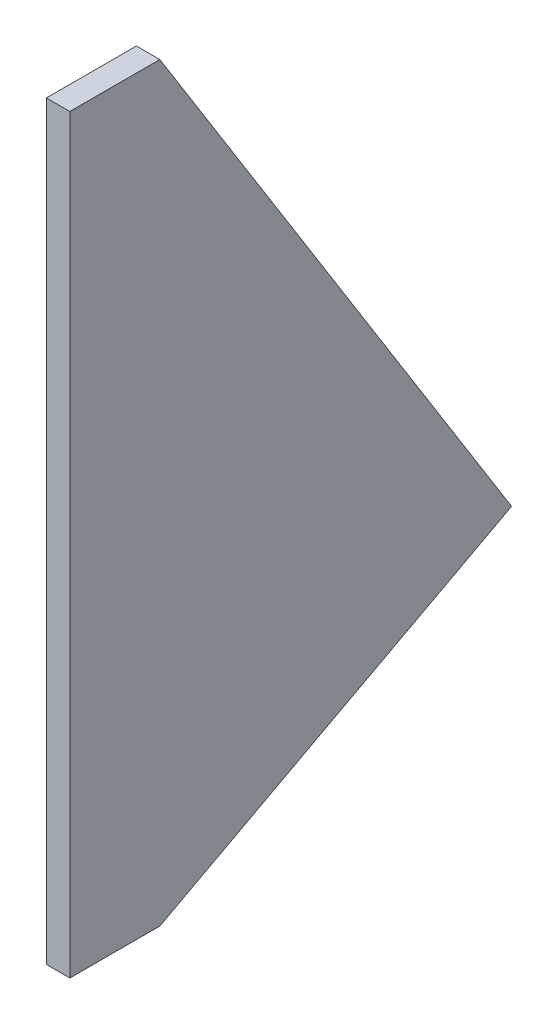
ISO-10303-21;
HEADER;
FILE_DESCRIPTION(('STEP AP214'),'2;1');
FILE_NAME('part.step','',(''),(''),'','','');
FILE_SCHEMA(('AUTOMOTIVE_DESIGN { 1 0 10303 214 1 1 1 1 }'));
ENDSEC;
DATA;
#1=APPLICATION_CONTEXT('core data for automotive mechanical design processes');
#2=APPLICATION_PROTOCOL_DEFINITION('international standard','automotive_design',2000,#1);
#3=PRODUCT_CONTEXT('',#1,'mechanical');
#4=PRODUCT('Part','Part','',(#3));
#5=PRODUCT_RELATED_PRODUCT_CATEGORY('part','',(#4));
#6=PRODUCT_DEFINITION_FORMATION('','',#4);
#7=PRODUCT_DEFINITION_CONTEXT('part definition',#1,'design');
#8=PRODUCT_DEFINITION('design','',#6,#7);
#9=PRODUCT_DEFINITION_SHAPE('','',#8);
#10=(LENGTH_UNIT() NAMED_UNIT(*) SI_UNIT(.MILLI.,.METRE.));
#11=(NAMED_UNIT(*) PLANE_ANGLE_UNIT() SI_UNIT($,.RADIAN.));
#12=(NAMED_UNIT(*) SI_UNIT($,.STERADIAN.) SOLID_ANGLE_UNIT());
#13=UNCERTAINTY_MEASURE_WITH_UNIT(LENGTH_MEASURE(1.E-05),#10,'distance_accuracy_value','');
#14=(GEOMETRIC_REPRESENTATION_CONTEXT(3) GLOBAL_UNCERTAINTY_ASSIGNED_CONTEXT((#13)) GLOBAL_UNIT_ASSIGNED_CONTEXT((#10,
#11,#12)) REPRESENTATION_CONTEXT('',''));
#15=CARTESIAN_POINT('',(0.,0.,0.));
#16=DIRECTION('',(0.,0.,1.));
#17=DIRECTION('',(1.,0.,0.));
#18=AXIS2_PLACEMENT_3D('',#15,#16,#17);
#19=CARTESIAN_POINT('',(3.175,0.,-24.3586));
#20=DIRECTION('',(0.,1.,0.));
#21=DIRECTION('',(0.,0.,1.));
#22=AXIS2_PLACEMENT_3D('',#19,#20,#21);
#23=PLANE('',#22);
#24=DIRECTION('',(0.,0.,-1.));
#25=VECTOR('',#24,1.);
#26=CARTESIAN_POINT('',(-3.175,0.,-24.3586));
#27=LINE('',#26,#25);
#28=CARTESIAN_POINT('',(-3.175,0.,0.));
#29=VERTEX_POINT('',#28);
#30=CARTESIAN_POINT('',(-3.175,0.,-24.3586));
#31=VERTEX_POINT('',#30);
#32=EDGE_CURVE('E107',#29,#31,#27,.T.);
#33=ORIENTED_EDGE('',*,*,#32,.T.);
#34=DIRECTION('',(-1.,0.,0.));
#35=VECTOR('',#34,1.);
#36=CARTESIAN_POINT('',(3.175,0.,-24.3586));
#37=LINE('',#36,#35);
#38=CARTESIAN_POINT('',(3.175,0.,-24.3586));
#39=VERTEX_POINT('',#38);
#40=EDGE_CURVE('E11',#39,#31,#37,.T.);
#41=ORIENTED_EDGE('',*,*,#40,.F.);
#42=DIRECTION('',(0.,0.,-1.));
#43=VECTOR('',#42,1.);
#44=CARTESIAN_POINT('',(3.175,0.,-24.3586));
#45=LINE('',#44,#43);
#46=CARTESIAN_POINT('',(3.175,0.,0.));
#47=VERTEX_POINT('',#46);
#48=EDGE_CURVE('E115',#47,#39,#45,.T.);
#49=ORIENTED_EDGE('',*,*,#48,.F.);
#50=DIRECTION('',(-1.,0.,0.));
#51=VECTOR('',#50,1.);
#52=CARTESIAN_POINT('',(3.175,0.,0.));
#53=LINE('',#52,#51);
#54=EDGE_CURVE('E103',#47,#29,#53,.T.);
#55=ORIENTED_EDGE('',*,*,#54,.T.);
#56=EDGE_LOOP('',(#33,#41,#49,#55));
#57=FACE_BOUND('',#56,.T.);
#58=ADVANCED_FACE('F33',(#57),#23,.F.);
#59=CARTESIAN_POINT('',(3.175,50.8,-119.6086));
#60=DIRECTION('',(0.,0.882352941176471,0.470588235294118));
#61=DIRECTION('',(0.,-0.470588235294118,0.882352941176471));
#62=AXIS2_PLACEMENT_3D('',#59,#60,#61);
#63=PLANE('',#62);
#64=DIRECTION('',(0.,0.470588235294118,-0.882352941176471));
#65=VECTOR('',#64,1.);
#66=CARTESIAN_POINT('',(-3.175,50.8,-119.6086));
#67=LINE('',#66,#65);
#68=CARTESIAN_POINT('',(-3.175,50.8,-119.6086));
#69=VERTEX_POINT('',#68);
#70=EDGE_CURVE('E110',#31,#69,#67,.T.);
#71=ORIENTED_EDGE('',*,*,#70,.T.);
#72=DIRECTION('',(-1.,0.,0.));
#73=VECTOR('',#72,1.);
#74=CARTESIAN_POINT('',(3.175,50.8,-119.6086));
#75=LINE('',#74,#73);
#76=CARTESIAN_POINT('',(3.175,50.8,-119.6086));
#77=VERTEX_POINT('',#76);
#78=EDGE_CURVE('E41',#77,#69,#75,.T.);
#79=ORIENTED_EDGE('',*,*,#78,.F.);
#80=DIRECTION('',(0.,0.470588235294118,-0.882352941176471));
#81=VECTOR('',#80,1.);
#82=CARTESIAN_POINT('',(3.175,50.8,-119.6086));
#83=LINE('',#82,#81);
#84=EDGE_CURVE('E83',#39,#77,#83,.T.);
#85=ORIENTED_EDGE('',*,*,#84,.F.);
#86=ORIENTED_EDGE('',*,*,#40,.T.);
#87=EDGE_LOOP('',(#71,#79,#85,#86));
#88=FACE_BOUND('',#87,.T.);
#89=ADVANCED_FACE('F134',(#88),#63,.F.);
#90=CARTESIAN_POINT('',(3.175,203.2,-24.3586));
#91=DIRECTION('',(0.,-0.52999894000318,0.847998304005088));
#92=DIRECTION('',(0.,-0.847998304005088,-0.52999894000318));
#93=AXIS2_PLACEMENT_3D('',#90,#91,#92);
#94=PLANE('',#93);
#95=DIRECTION('',(0.,0.847998304005088,0.52999894000318));
#96=VECTOR('',#95,1.);
#97=CARTESIAN_POINT('',(-3.175,203.2,-24.3586));
#98=LINE('',#97,#96);
#99=CARTESIAN_POINT('',(-3.175,203.2,-24.3586));
#100=VERTEX_POINT('',#99);
#101=EDGE_CURVE('E98',#69,#100,#98,.T.);
#102=ORIENTED_EDGE('',*,*,#101,.T.);
#103=DIRECTION('',(-1.,0.,0.));
#104=VECTOR('',#103,1.);
#105=CARTESIAN_POINT('',(3.175,203.2,-24.3586));
#106=LINE('',#105,#104);
#107=CARTESIAN_POINT('',(3.175,203.2,-24.3586));
#108=VERTEX_POINT('',#107);
#109=EDGE_CURVE('E95',#108,#100,#106,.T.);
#110=ORIENTED_EDGE('',*,*,#109,.F.);
#111=DIRECTION('',(0.,0.847998304005088,0.52999894000318));
#112=VECTOR('',#111,1.);
#113=CARTESIAN_POINT('',(3.175,203.2,-24.3586));
#114=LINE('',#113,#112);
#115=EDGE_CURVE('E87',#77,#108,#114,.T.);
#116=ORIENTED_EDGE('',*,*,#115,.F.);
#117=ORIENTED_EDGE('',*,*,#78,.T.);
#118=EDGE_LOOP('',(#102,#110,#116,#117));
#119=FACE_BOUND('',#118,.T.);
#120=ADVANCED_FACE('F96',(#119),#94,.F.);
#121=CARTESIAN_POINT('',(3.175,203.2,0.));
#122=DIRECTION('',(0.,-1.,0.));
#123=DIRECTION('',(0.,0.,-1.));
#124=AXIS2_PLACEMENT_3D('',#121,#122,#123);
#125=PLANE('',#124);
#126=DIRECTION('',(0.,0.,1.));
#127=VECTOR('',#126,1.);
#128=CARTESIAN_POINT('',(-3.175,203.2,0.));
#129=LINE('',#128,#127);
#130=CARTESIAN_POINT('',(-3.175,203.2,0.));
#131=VERTEX_POINT('',#130);
#132=EDGE_CURVE('E69',#100,#131,#129,.T.);
#133=ORIENTED_EDGE('',*,*,#132,.T.);
#134=DIRECTION('',(-1.,0.,0.));
#135=VECTOR('',#134,1.);
#136=CARTESIAN_POINT('',(3.175,203.2,0.));
#137=LINE('',#136,#135);
#138=CARTESIAN_POINT('',(3.175,203.2,0.));
#139=VERTEX_POINT('',#138);
#140=EDGE_CURVE('E99',#139,#131,#137,.T.);
#141=ORIENTED_EDGE('',*,*,#140,.F.);
#142=DIRECTION('',(0.,0.,1.));
#143=VECTOR('',#142,1.);
#144=CARTESIAN_POINT('',(3.175,203.2,0.));
#145=LINE('',#144,#143);
#146=EDGE_CURVE('E91',#108,#139,#145,.T.);
#147=ORIENTED_EDGE('',*,*,#146,.F.);
#148=ORIENTED_EDGE('',*,*,#109,.T.);
#149=EDGE_LOOP('',(#133,#141,#147,#148));
#150=FACE_BOUND('',#149,.T.);
#151=ADVANCED_FACE('F101',(#150),#125,.F.);
#152=CARTESIAN_POINT('',(3.175,0.,0.));
#153=DIRECTION('',(0.,0.,-1.));
#154=DIRECTION('',(-1.,0.,0.));
#155=AXIS2_PLACEMENT_3D('',#152,#153,#154);
#156=PLANE('',#155);
#157=DIRECTION('',(0.,-1.,0.));
#158=VECTOR('',#157,1.);
#159=CARTESIAN_POINT('',(-3.175,0.,0.));
#160=LINE('',#159,#158);
#161=EDGE_CURVE('E75',#131,#29,#160,.T.);
#162=ORIENTED_EDGE('',*,*,#161,.T.);
#163=ORIENTED_EDGE('',*,*,#54,.F.);
#164=DIRECTION('',(0.,-1.,0.));
#165=VECTOR('',#164,1.);
#166=CARTESIAN_POINT('',(3.175,0.,0.));
#167=LINE('',#166,#165);
#168=EDGE_CURVE('E49',#139,#47,#167,.T.);
#169=ORIENTED_EDGE('',*,*,#168,.F.);
#170=ORIENTED_EDGE('',*,*,#140,.T.);
#171=EDGE_LOOP('',(#162,#163,#169,#170));
#172=FACE_BOUND('',#171,.T.);
#173=ADVANCED_FACE('F123',(#172),#156,.F.);
#174=CARTESIAN_POINT('',(3.175,0.,0.));
#175=DIRECTION('',(-1.,0.,0.));
#176=DIRECTION('',(0.,0.,1.));
#177=AXIS2_PLACEMENT_3D('',#174,#175,#176);
#178=PLANE('',#177);
#179=ORIENTED_EDGE('',*,*,#48,.T.);
#180=ORIENTED_EDGE('',*,*,#84,.T.);
#181=ORIENTED_EDGE('',*,*,#115,.T.);
#182=ORIENTED_EDGE('',*,*,#146,.T.);
#183=ORIENTED_EDGE('',*,*,#168,.T.);
#184=EDGE_LOOP('',(#179,#180,#181,#182,#183));
#185=FACE_BOUND('',#184,.T.);
#186=ADVANCED_FACE('F89',(#185),#178,.F.);
#187=CARTESIAN_POINT('',(-3.175,0.,0.));
#188=DIRECTION('',(-1.,0.,0.));
#189=DIRECTION('',(0.,0.,1.));
#190=AXIS2_PLACEMENT_3D('',#187,#188,#189);
#191=PLANE('',#190);
#192=ORIENTED_EDGE('',*,*,#32,.F.);
#193=ORIENTED_EDGE('',*,*,#161,.F.);
#194=ORIENTED_EDGE('',*,*,#132,.F.);
#195=ORIENTED_EDGE('',*,*,#101,.F.);
#196=ORIENTED_EDGE('',*,*,#70,.F.);
#197=EDGE_LOOP('',(#192,#193,#194,#195,#196));
#198=FACE_BOUND('',#197,.T.);
#199=ADVANCED_FACE('F119',(#198),#191,.T.);
#200=CLOSED_SHELL('',(#58,#89,#120,#151,#173,#186,#199));
#201=MANIFOLD_SOLID_BREP('B2',#200);
#202=ADVANCED_BREP_SHAPE_REPRESENTATION('',(#18,#201),#14);
#203=SHAPE_DEFINITION_REPRESENTATION(#9,#202);
ENDSEC;
END-ISO-10303-21;
